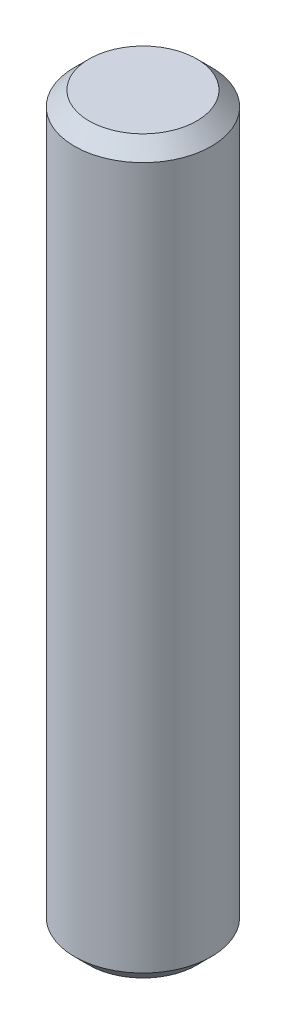
ISO-10303-21;
HEADER;
FILE_DESCRIPTION(('STEP AP214'),'2;1');
FILE_NAME('part.step','',(''),(''),'','','');
FILE_SCHEMA(('AUTOMOTIVE_DESIGN { 1 0 10303 214 1 1 1 1 }'));
ENDSEC;
DATA;
#1=APPLICATION_CONTEXT('core data for automotive mechanical design processes');
#2=APPLICATION_PROTOCOL_DEFINITION('international standard','automotive_design',2000,#1);
#3=PRODUCT_CONTEXT('',#1,'mechanical');
#4=PRODUCT('Part','Part','',(#3));
#5=PRODUCT_RELATED_PRODUCT_CATEGORY('part','',(#4));
#6=PRODUCT_DEFINITION_FORMATION('','',#4);
#7=PRODUCT_DEFINITION_CONTEXT('part definition',#1,'design');
#8=PRODUCT_DEFINITION('design','',#6,#7);
#9=PRODUCT_DEFINITION_SHAPE('','',#8);
#10=(LENGTH_UNIT() NAMED_UNIT(*) SI_UNIT(.MILLI.,.METRE.));
#11=(NAMED_UNIT(*) PLANE_ANGLE_UNIT() SI_UNIT($,.RADIAN.));
#12=(NAMED_UNIT(*) SI_UNIT($,.STERADIAN.) SOLID_ANGLE_UNIT());
#13=UNCERTAINTY_MEASURE_WITH_UNIT(LENGTH_MEASURE(1.E-05),#10,'distance_accuracy_value','');
#14=(GEOMETRIC_REPRESENTATION_CONTEXT(3) GLOBAL_UNCERTAINTY_ASSIGNED_CONTEXT((#13)) GLOBAL_UNIT_ASSIGNED_CONTEXT((#10,
#11,#12)) REPRESENTATION_CONTEXT('',''));
#15=CARTESIAN_POINT('',(0.,0.,0.));
#16=DIRECTION('',(0.,0.,1.));
#17=DIRECTION('',(1.,0.,0.));
#18=AXIS2_PLACEMENT_3D('',#15,#16,#17);
#19=CARTESIAN_POINT('',(-2.84400944537479E-11,0.508000000000005,0.));
#20=DIRECTION('',(0.,1.,0.));
#21=DIRECTION('',(0.,0.,1.));
#22=AXIS2_PLACEMENT_3D('',#19,#20,#21);
#23=CONICAL_SURFACE('',#22,2.37743999997882,0.785398163397448);
#24=CARTESIAN_POINT('',(-2.84400944537479E-11,2.84219317506868E-11,0.));
#25=DIRECTION('',(0.,1.,0.));
#26=DIRECTION('',(0.,0.,1.));
#27=AXIS2_PLACEMENT_3D('',#24,#25,#26);
#28=CIRCLE('',#27,1.86944000000723);
#29=CARTESIAN_POINT('',(-2.84400944537479E-11,2.84219317506868E-11,1.86944000000723));
#30=VERTEX_POINT('',#29);
#31=EDGE_CURVE('E45',#30,#30,#28,.T.);
#32=ORIENTED_EDGE('',*,*,#31,.T.);
#33=EDGE_LOOP('',(#32));
#34=FACE_BOUND('',#33,.T.);
#35=CARTESIAN_POINT('',(-2.84400944537479E-11,0.508000000000005,0.));
#36=DIRECTION('',(0.,1.,0.));
#37=DIRECTION('',(0.,0.,1.));
#38=AXIS2_PLACEMENT_3D('',#35,#36,#37);
#39=CIRCLE('',#38,2.37743999997882);
#40=CARTESIAN_POINT('',(-2.84400944537479E-11,0.508000000000005,2.37743999997882));
#41=VERTEX_POINT('',#40);
#42=EDGE_CURVE('E10',#41,#41,#39,.T.);
#43=ORIENTED_EDGE('',*,*,#42,.F.);
#44=EDGE_LOOP('',(#43));
#45=FACE_BOUND('',#44,.T.);
#46=ADVANCED_FACE('F31',(#34,#45),#23,.T.);
#47=CARTESIAN_POINT('',(-2.84400944537479E-11,2.84219317506868E-11,0.));
#48=DIRECTION('',(0.,1.,0.));
#49=DIRECTION('',(0.,0.,1.));
#50=AXIS2_PLACEMENT_3D('',#47,#48,#49);
#51=CYLINDRICAL_SURFACE('',#50,2.37743999997882);
#52=ORIENTED_EDGE('',*,*,#42,.T.);
#53=EDGE_LOOP('',(#52));
#54=FACE_BOUND('',#53,.T.);
#55=CARTESIAN_POINT('',(-2.84400944537479E-11,24.8920000000546,0.));
#56=DIRECTION('',(0.,1.,0.));
#57=DIRECTION('',(0.,0.,1.));
#58=AXIS2_PLACEMENT_3D('',#55,#56,#57);
#59=CIRCLE('',#58,2.37743999997882);
#60=CARTESIAN_POINT('',(-2.84400944537479E-11,24.8920000000546,2.37743999997882));
#61=VERTEX_POINT('',#60);
#62=EDGE_CURVE('E37',#61,#61,#59,.T.);
#63=ORIENTED_EDGE('',*,*,#62,.F.);
#64=EDGE_LOOP('',(#63));
#65=FACE_BOUND('',#64,.T.);
#66=ADVANCED_FACE('F64',(#54,#65),#51,.T.);
#67=CARTESIAN_POINT('',(-2.84400944537479E-11,25.4000000000237,0.));
#68=DIRECTION('',(0.,-1.,0.));
#69=DIRECTION('',(0.,0.,-1.));
#70=AXIS2_PLACEMENT_3D('',#67,#68,#69);
#71=CONICAL_SURFACE('',#70,1.86944000000973,0.785398163397447);
#72=ORIENTED_EDGE('',*,*,#62,.T.);
#73=EDGE_LOOP('',(#72));
#74=FACE_BOUND('',#73,.T.);
#75=CARTESIAN_POINT('',(-2.84400944537479E-11,25.4000000000237,0.));
#76=DIRECTION('',(0.,1.,0.));
#77=DIRECTION('',(0.,0.,1.));
#78=AXIS2_PLACEMENT_3D('',#75,#76,#77);
#79=CIRCLE('',#78,1.86944000000973);
#80=CARTESIAN_POINT('',(-2.84400944537479E-11,25.4000000000237,1.86944000000973));
#81=VERTEX_POINT('',#80);
#82=EDGE_CURVE('E41',#81,#81,#79,.T.);
#83=ORIENTED_EDGE('',*,*,#82,.F.);
#84=EDGE_LOOP('',(#83));
#85=FACE_BOUND('',#84,.T.);
#86=ADVANCED_FACE('F60',(#74,#85),#71,.T.);
#87=CARTESIAN_POINT('',(-2.84400944537479E-11,25.4000000000237,0.));
#88=DIRECTION('',(0.,1.,0.));
#89=DIRECTION('',(0.,0.,1.));
#90=AXIS2_PLACEMENT_3D('',#87,#88,#89);
#91=PLANE('',#90);
#92=ORIENTED_EDGE('',*,*,#82,.T.);
#93=EDGE_LOOP('',(#92));
#94=FACE_BOUND('',#93,.T.);
#95=ADVANCED_FACE('F55',(#94),#91,.T.);
#96=CARTESIAN_POINT('',(1.86943999997879,2.84219317506868E-11,0.));
#97=DIRECTION('',(0.,-1.,0.));
#98=DIRECTION('',(0.,0.,-1.));
#99=AXIS2_PLACEMENT_3D('',#96,#97,#98);
#100=PLANE('',#99);
#101=ORIENTED_EDGE('',*,*,#31,.F.);
#102=EDGE_LOOP('',(#101));
#103=FACE_BOUND('',#102,.T.);
#104=ADVANCED_FACE('F53',(#103),#100,.T.);
#105=CLOSED_SHELL('',(#46,#66,#86,#95,#104));
#106=MANIFOLD_SOLID_BREP('B2',#105);
#107=ADVANCED_BREP_SHAPE_REPRESENTATION('',(#18,#106),#14);
#108=SHAPE_DEFINITION_REPRESENTATION(#9,#107);
ENDSEC;
END-ISO-10303-21;
